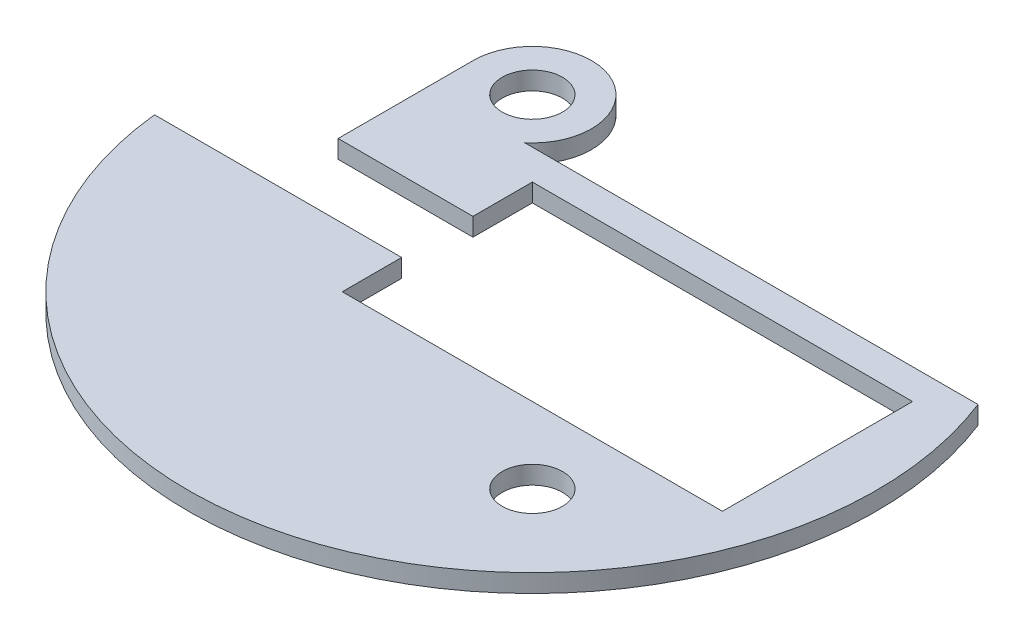
ISO-10303-21;
HEADER;
FILE_DESCRIPTION(('STEP AP214'),'2;1');
FILE_NAME('part.step','',(''),(''),'','','');
FILE_SCHEMA(('AUTOMOTIVE_DESIGN { 1 0 10303 214 1 1 1 1 }'));
ENDSEC;
DATA;
#1=APPLICATION_CONTEXT('core data for automotive mechanical design processes');
#2=APPLICATION_PROTOCOL_DEFINITION('international standard','automotive_design',2000,#1);
#3=PRODUCT_CONTEXT('',#1,'mechanical');
#4=PRODUCT('Part','Part','',(#3));
#5=PRODUCT_RELATED_PRODUCT_CATEGORY('part','',(#4));
#6=PRODUCT_DEFINITION_FORMATION('','',#4);
#7=PRODUCT_DEFINITION_CONTEXT('part definition',#1,'design');
#8=PRODUCT_DEFINITION('design','',#6,#7);
#9=PRODUCT_DEFINITION_SHAPE('','',#8);
#10=(LENGTH_UNIT() NAMED_UNIT(*) SI_UNIT(.MILLI.,.METRE.));
#11=(NAMED_UNIT(*) PLANE_ANGLE_UNIT() SI_UNIT($,.RADIAN.));
#12=(NAMED_UNIT(*) SI_UNIT($,.STERADIAN.) SOLID_ANGLE_UNIT());
#13=UNCERTAINTY_MEASURE_WITH_UNIT(LENGTH_MEASURE(1.E-05),#10,'distance_accuracy_value','');
#14=(GEOMETRIC_REPRESENTATION_CONTEXT(3) GLOBAL_UNCERTAINTY_ASSIGNED_CONTEXT((#13)) GLOBAL_UNIT_ASSIGNED_CONTEXT((#10,
#11,#12)) REPRESENTATION_CONTEXT('',''));
#15=CARTESIAN_POINT('',(0.,0.,0.));
#16=DIRECTION('',(0.,0.,1.));
#17=DIRECTION('',(1.,0.,0.));
#18=AXIS2_PLACEMENT_3D('',#15,#16,#17);
#19=CARTESIAN_POINT('',(0.,1.905,0.));
#20=DIRECTION('',(0.,1.,0.));
#21=DIRECTION('',(0.,0.,1.));
#22=AXIS2_PLACEMENT_3D('',#19,#20,#21);
#23=PLANE('',#22);
#24=CARTESIAN_POINT('',(-17.9605122421383,1.905,-17.9605122421383));
#25=DIRECTION('',(0.,1.,0.));
#26=DIRECTION('',(0.,0.,1.));
#27=AXIS2_PLACEMENT_3D('',#24,#25,#26);
#28=CIRCLE('',#27,3.175);
#29=CARTESIAN_POINT('',(-17.9605122421383,1.905,-14.7855122421383));
#30=VERTEX_POINT('',#29);
#31=EDGE_CURVE('E157',#30,#30,#28,.T.);
#32=ORIENTED_EDGE('',*,*,#31,.F.);
#33=EDGE_LOOP('',(#32));
#34=FACE_BOUND('',#33,.T.);
#35=DIRECTION('',(0.,0.,-1.));
#36=VECTOR('',#35,1.);
#37=CARTESIAN_POINT('',(-10.,1.905,-3.75));
#38=LINE('',#37,#36);
#39=CARTESIAN_POINT('',(-10.,1.905,-3.75));
#40=VERTEX_POINT('',#39);
#41=CARTESIAN_POINT('',(-10.,1.905,-10.));
#42=VERTEX_POINT('',#41);
#43=EDGE_CURVE('E177',#40,#42,#38,.T.);
#44=ORIENTED_EDGE('',*,*,#43,.T.);
#45=DIRECTION('',(1.,0.,0.));
#46=VECTOR('',#45,1.);
#47=CARTESIAN_POINT('',(30.,1.905,-10.));
#48=LINE('',#47,#46);
#49=CARTESIAN_POINT('',(30.,1.905,-10.));
#50=VERTEX_POINT('',#49);
#51=EDGE_CURVE('E108',#42,#50,#48,.T.);
#52=ORIENTED_EDGE('',*,*,#51,.T.);
#53=DIRECTION('',(0.,0.,1.));
#54=VECTOR('',#53,1.);
#55=CARTESIAN_POINT('',(30.,1.905,10.));
#56=LINE('',#55,#54);
#57=CARTESIAN_POINT('',(30.,1.905,10.));
#58=VERTEX_POINT('',#57);
#59=EDGE_CURVE('E201',#50,#58,#56,.T.);
#60=ORIENTED_EDGE('',*,*,#59,.T.);
#61=DIRECTION('',(-1.,0.,0.));
#62=VECTOR('',#61,1.);
#63=CARTESIAN_POINT('',(30.,1.905,10.));
#64=LINE('',#63,#62);
#65=CARTESIAN_POINT('',(-10.,1.905,10.));
#66=VERTEX_POINT('',#65);
#67=EDGE_CURVE('E218',#58,#66,#64,.T.);
#68=ORIENTED_EDGE('',*,*,#67,.T.);
#69=DIRECTION('',(0.,0.,-1.));
#70=VECTOR('',#69,1.);
#71=CARTESIAN_POINT('',(-10.,1.905,10.));
#72=LINE('',#71,#70);
#73=CARTESIAN_POINT('',(-10.,1.905,3.75));
#74=VERTEX_POINT('',#73);
#75=EDGE_CURVE('E215',#66,#74,#72,.T.);
#76=ORIENTED_EDGE('',*,*,#75,.T.);
#77=DIRECTION('',(-1.,0.,0.));
#78=VECTOR('',#77,1.);
#79=CARTESIAN_POINT('',(-24.1835122421383,1.905,3.75));
#80=LINE('',#79,#78);
#81=CARTESIAN_POINT('',(-36.0002156243543,1.905,3.75));
#82=VERTEX_POINT('',#81);
#83=EDGE_CURVE('E217',#74,#82,#80,.T.);
#84=ORIENTED_EDGE('',*,*,#83,.T.);
#85=CARTESIAN_POINT('',(0.,1.905,0.));
#86=DIRECTION('',(0.,1.,0.));
#87=DIRECTION('',(0.,0.,1.));
#88=AXIS2_PLACEMENT_3D('',#85,#86,#87);
#89=CIRCLE('',#88,36.195);
#90=CARTESIAN_POINT('',(33.7119771001346,1.905,-13.175));
#91=VERTEX_POINT('',#90);
#92=EDGE_CURVE('E220',#82,#91,#89,.T.);
#93=ORIENTED_EDGE('',*,*,#92,.T.);
#94=DIRECTION('',(-1.,0.,0.));
#95=VECTOR('',#94,1.);
#96=CARTESIAN_POINT('',(33.7119771001346,1.905,-13.175));
#97=LINE('',#96,#95);
#98=CARTESIAN_POINT('',(-13.9824974633392,1.905,-13.175));
#99=VERTEX_POINT('',#98);
#100=EDGE_CURVE('E136',#91,#99,#97,.T.);
#101=ORIENTED_EDGE('',*,*,#100,.T.);
#102=CARTESIAN_POINT('',(-17.9605122421383,1.905,-17.9605122421383));
#103=DIRECTION('',(0.,1.,0.));
#104=DIRECTION('',(0.,0.,1.));
#105=AXIS2_PLACEMENT_3D('',#102,#103,#104);
#106=CIRCLE('',#105,6.223);
#107=CARTESIAN_POINT('',(-24.1835122421383,1.905,-17.9605122421383));
#108=VERTEX_POINT('',#107);
#109=EDGE_CURVE('E130',#99,#108,#106,.T.);
#110=ORIENTED_EDGE('',*,*,#109,.T.);
#111=DIRECTION('',(0.,0.,1.));
#112=VECTOR('',#111,1.);
#113=CARTESIAN_POINT('',(-24.1835122421383,1.905,-17.9605122421383));
#114=LINE('',#113,#112);
#115=CARTESIAN_POINT('',(-24.1835122421383,1.905,-3.75));
#116=VERTEX_POINT('',#115);
#117=EDGE_CURVE('E134',#108,#116,#114,.T.);
#118=ORIENTED_EDGE('',*,*,#117,.T.);
#119=DIRECTION('',(1.,0.,0.));
#120=VECTOR('',#119,1.);
#121=CARTESIAN_POINT('',(-24.1835122421383,1.905,-3.75));
#122=LINE('',#121,#120);
#123=EDGE_CURVE('E56',#116,#40,#122,.T.);
#124=ORIENTED_EDGE('',*,*,#123,.T.);
#125=EDGE_LOOP('',(#44,#52,#60,#68,#76,#84,#93,#101,#110,#118,#124));
#126=FACE_BOUND('',#125,.T.);
#127=CARTESIAN_POINT('',(17.9605122421383,1.905,17.9605122421383));
#128=DIRECTION('',(0.,1.,0.));
#129=DIRECTION('',(0.,0.,1.));
#130=AXIS2_PLACEMENT_3D('',#127,#128,#129);
#131=CIRCLE('',#130,3.175);
#132=CARTESIAN_POINT('',(17.9605122421383,1.905,21.1355122421383));
#133=VERTEX_POINT('',#132);
#134=EDGE_CURVE('E265',#133,#133,#131,.T.);
#135=ORIENTED_EDGE('',*,*,#134,.F.);
#136=EDGE_LOOP('',(#135));
#137=FACE_BOUND('',#136,.T.);
#138=ADVANCED_FACE('F39',(#34,#126,#137),#23,.T.);
#139=CARTESIAN_POINT('',(0.,0.,0.));
#140=DIRECTION('',(0.,1.,0.));
#141=DIRECTION('',(0.,0.,1.));
#142=AXIS2_PLACEMENT_3D('',#139,#140,#141);
#143=PLANE('',#142);
#144=DIRECTION('',(0.,0.,-1.));
#145=VECTOR('',#144,1.);
#146=CARTESIAN_POINT('',(-10.,0.,-3.75));
#147=LINE('',#146,#145);
#148=CARTESIAN_POINT('',(-10.,0.,-3.75));
#149=VERTEX_POINT('',#148);
#150=CARTESIAN_POINT('',(-10.,0.,-10.));
#151=VERTEX_POINT('',#150);
#152=EDGE_CURVE('E153',#149,#151,#147,.T.);
#153=ORIENTED_EDGE('',*,*,#152,.F.);
#154=DIRECTION('',(1.,0.,0.));
#155=VECTOR('',#154,1.);
#156=CARTESIAN_POINT('',(-24.1835122421383,0.,-3.75));
#157=LINE('',#156,#155);
#158=CARTESIAN_POINT('',(-24.1835122421383,0.,-3.75));
#159=VERTEX_POINT('',#158);
#160=EDGE_CURVE('E100',#159,#149,#157,.T.);
#161=ORIENTED_EDGE('',*,*,#160,.F.);
#162=DIRECTION('',(0.,0.,1.));
#163=VECTOR('',#162,1.);
#164=CARTESIAN_POINT('',(-24.1835122421383,0.,-17.9605122421383));
#165=LINE('',#164,#163);
#166=CARTESIAN_POINT('',(-24.1835122421383,0.,-17.9605122421383));
#167=VERTEX_POINT('',#166);
#168=EDGE_CURVE('E94',#167,#159,#165,.T.);
#169=ORIENTED_EDGE('',*,*,#168,.F.);
#170=CARTESIAN_POINT('',(-17.9605122421383,0.,-17.9605122421383));
#171=DIRECTION('',(0.,1.,0.));
#172=DIRECTION('',(0.,0.,1.));
#173=AXIS2_PLACEMENT_3D('',#170,#171,#172);
#174=CIRCLE('',#173,6.223);
#175=CARTESIAN_POINT('',(-13.9824974633392,0.,-13.175));
#176=VERTEX_POINT('',#175);
#177=EDGE_CURVE('E143',#176,#167,#174,.T.);
#178=ORIENTED_EDGE('',*,*,#177,.F.);
#179=DIRECTION('',(-1.,0.,0.));
#180=VECTOR('',#179,1.);
#181=CARTESIAN_POINT('',(33.7119771001346,0.,-13.175));
#182=LINE('',#181,#180);
#183=CARTESIAN_POINT('',(33.7119771001346,0.,-13.175));
#184=VERTEX_POINT('',#183);
#185=EDGE_CURVE('E171',#184,#176,#182,.T.);
#186=ORIENTED_EDGE('',*,*,#185,.F.);
#187=CARTESIAN_POINT('',(0.,0.,0.));
#188=DIRECTION('',(0.,1.,0.));
#189=DIRECTION('',(0.,0.,1.));
#190=AXIS2_PLACEMENT_3D('',#187,#188,#189);
#191=CIRCLE('',#190,36.195);
#192=CARTESIAN_POINT('',(-36.0002156243543,0.,3.75));
#193=VERTEX_POINT('',#192);
#194=EDGE_CURVE('E169',#193,#184,#191,.T.);
#195=ORIENTED_EDGE('',*,*,#194,.F.);
#196=DIRECTION('',(-1.,0.,0.));
#197=VECTOR('',#196,1.);
#198=CARTESIAN_POINT('',(-24.1835122421383,0.,3.75));
#199=LINE('',#198,#197);
#200=CARTESIAN_POINT('',(-10.,0.,3.75));
#201=VERTEX_POINT('',#200);
#202=EDGE_CURVE('E167',#201,#193,#199,.T.);
#203=ORIENTED_EDGE('',*,*,#202,.F.);
#204=DIRECTION('',(0.,0.,-1.));
#205=VECTOR('',#204,1.);
#206=CARTESIAN_POINT('',(-10.,0.,10.));
#207=LINE('',#206,#205);
#208=CARTESIAN_POINT('',(-10.,0.,10.));
#209=VERTEX_POINT('',#208);
#210=EDGE_CURVE('E164',#209,#201,#207,.T.);
#211=ORIENTED_EDGE('',*,*,#210,.F.);
#212=DIRECTION('',(-1.,0.,0.));
#213=VECTOR('',#212,1.);
#214=CARTESIAN_POINT('',(0.,0.,10.));
#215=LINE('',#214,#213);
#216=CARTESIAN_POINT('',(30.,0.,10.));
#217=VERTEX_POINT('',#216);
#218=EDGE_CURVE('E162',#217,#209,#215,.T.);
#219=ORIENTED_EDGE('',*,*,#218,.F.);
#220=DIRECTION('',(0.,0.,1.));
#221=VECTOR('',#220,1.);
#222=CARTESIAN_POINT('',(30.,0.,10.));
#223=LINE('',#222,#221);
#224=CARTESIAN_POINT('',(30.,0.,-10.));
#225=VERTEX_POINT('',#224);
#226=EDGE_CURVE('E159',#225,#217,#223,.T.);
#227=ORIENTED_EDGE('',*,*,#226,.F.);
#228=DIRECTION('',(1.,0.,0.));
#229=VECTOR('',#228,1.);
#230=CARTESIAN_POINT('',(30.,0.,-10.));
#231=LINE('',#230,#229);
#232=EDGE_CURVE('E156',#151,#225,#231,.T.);
#233=ORIENTED_EDGE('',*,*,#232,.F.);
#234=EDGE_LOOP('',(#153,#161,#169,#178,#186,#195,#203,#211,#219,#227,#233));
#235=FACE_BOUND('',#234,.T.);
#236=CARTESIAN_POINT('',(-17.9605122421383,0.,-17.9605122421383));
#237=DIRECTION('',(0.,1.,0.));
#238=DIRECTION('',(0.,0.,1.));
#239=AXIS2_PLACEMENT_3D('',#236,#237,#238);
#240=CIRCLE('',#239,3.175);
#241=CARTESIAN_POINT('',(-17.9605122421383,0.,-14.7855122421383));
#242=VERTEX_POINT('',#241);
#243=EDGE_CURVE('E271',#242,#242,#240,.T.);
#244=ORIENTED_EDGE('',*,*,#243,.T.);
#245=EDGE_LOOP('',(#244));
#246=FACE_BOUND('',#245,.T.);
#247=CARTESIAN_POINT('',(17.9605122421383,0.,17.9605122421383));
#248=DIRECTION('',(0.,1.,0.));
#249=DIRECTION('',(0.,0.,1.));
#250=AXIS2_PLACEMENT_3D('',#247,#248,#249);
#251=CIRCLE('',#250,3.175);
#252=CARTESIAN_POINT('',(17.9605122421383,0.,21.1355122421383));
#253=VERTEX_POINT('',#252);
#254=EDGE_CURVE('E268',#253,#253,#251,.T.);
#255=ORIENTED_EDGE('',*,*,#254,.T.);
#256=EDGE_LOOP('',(#255));
#257=FACE_BOUND('',#256,.T.);
#258=ADVANCED_FACE('F204',(#235,#246,#257),#143,.F.);
#259=CARTESIAN_POINT('',(-10.,1.905,-3.75));
#260=DIRECTION('',(-1.,0.,0.));
#261=DIRECTION('',(0.,0.,1.));
#262=AXIS2_PLACEMENT_3D('',#259,#260,#261);
#263=PLANE('',#262);
#264=ORIENTED_EDGE('',*,*,#152,.T.);
#265=DIRECTION('',(0.,-1.,0.));
#266=VECTOR('',#265,1.);
#267=CARTESIAN_POINT('',(-10.,1.905,-10.));
#268=LINE('',#267,#266);
#269=EDGE_CURVE('E11',#42,#151,#268,.T.);
#270=ORIENTED_EDGE('',*,*,#269,.F.);
#271=ORIENTED_EDGE('',*,*,#43,.F.);
#272=DIRECTION('',(0.,-1.,0.));
#273=VECTOR('',#272,1.);
#274=CARTESIAN_POINT('',(-10.,1.905,-3.75));
#275=LINE('',#274,#273);
#276=EDGE_CURVE('E149',#40,#149,#275,.T.);
#277=ORIENTED_EDGE('',*,*,#276,.T.);
#278=EDGE_LOOP('',(#264,#270,#271,#277));
#279=FACE_BOUND('',#278,.T.);
#280=ADVANCED_FACE('F41',(#279),#263,.F.);
#281=CARTESIAN_POINT('',(30.,1.905,-10.));
#282=DIRECTION('',(0.,0.,-1.));
#283=DIRECTION('',(-1.,0.,0.));
#284=AXIS2_PLACEMENT_3D('',#281,#282,#283);
#285=PLANE('',#284);
#286=ORIENTED_EDGE('',*,*,#232,.T.);
#287=DIRECTION('',(0.,-1.,0.));
#288=VECTOR('',#287,1.);
#289=CARTESIAN_POINT('',(30.,1.905,-10.));
#290=LINE('',#289,#288);
#291=EDGE_CURVE('E48',#50,#225,#290,.T.);
#292=ORIENTED_EDGE('',*,*,#291,.F.);
#293=ORIENTED_EDGE('',*,*,#51,.F.);
#294=ORIENTED_EDGE('',*,*,#269,.T.);
#295=EDGE_LOOP('',(#286,#292,#293,#294));
#296=FACE_BOUND('',#295,.T.);
#297=ADVANCED_FACE('F352',(#296),#285,.F.);
#298=CARTESIAN_POINT('',(30.,1.905,10.));
#299=DIRECTION('',(1.,0.,0.));
#300=DIRECTION('',(0.,0.,-1.));
#301=AXIS2_PLACEMENT_3D('',#298,#299,#300);
#302=PLANE('',#301);
#303=ORIENTED_EDGE('',*,*,#226,.T.);
#304=DIRECTION('',(0.,-1.,0.));
#305=VECTOR('',#304,1.);
#306=CARTESIAN_POINT('',(30.,1.905,10.));
#307=LINE('',#306,#305);
#308=EDGE_CURVE('E193',#58,#217,#307,.T.);
#309=ORIENTED_EDGE('',*,*,#308,.F.);
#310=ORIENTED_EDGE('',*,*,#59,.F.);
#311=ORIENTED_EDGE('',*,*,#291,.T.);
#312=EDGE_LOOP('',(#303,#309,#310,#311));
#313=FACE_BOUND('',#312,.T.);
#314=ADVANCED_FACE('F199',(#313),#302,.F.);
#315=CARTESIAN_POINT('',(0.,1.905,10.));
#316=DIRECTION('',(0.,0.,1.));
#317=DIRECTION('',(1.,0.,0.));
#318=AXIS2_PLACEMENT_3D('',#315,#316,#317);
#319=PLANE('',#318);
#320=ORIENTED_EDGE('',*,*,#218,.T.);
#321=DIRECTION('',(0.,-1.,0.));
#322=VECTOR('',#321,1.);
#323=CARTESIAN_POINT('',(-10.,1.905,10.));
#324=LINE('',#323,#322);
#325=EDGE_CURVE('E190',#66,#209,#324,.T.);
#326=ORIENTED_EDGE('',*,*,#325,.F.);
#327=ORIENTED_EDGE('',*,*,#67,.F.);
#328=ORIENTED_EDGE('',*,*,#308,.T.);
#329=EDGE_LOOP('',(#320,#326,#327,#328));
#330=FACE_BOUND('',#329,.T.);
#331=ADVANCED_FACE('F209',(#330),#319,.F.);
#332=CARTESIAN_POINT('',(-10.,1.905,10.));
#333=DIRECTION('',(-1.,0.,0.));
#334=DIRECTION('',(0.,0.,1.));
#335=AXIS2_PLACEMENT_3D('',#332,#333,#334);
#336=PLANE('',#335);
#337=ORIENTED_EDGE('',*,*,#210,.T.);
#338=DIRECTION('',(0.,-1.,0.));
#339=VECTOR('',#338,1.);
#340=CARTESIAN_POINT('',(-10.,1.905,3.75));
#341=LINE('',#340,#339);
#342=EDGE_CURVE('E187',#74,#201,#341,.T.);
#343=ORIENTED_EDGE('',*,*,#342,.F.);
#344=ORIENTED_EDGE('',*,*,#75,.F.);
#345=ORIENTED_EDGE('',*,*,#325,.T.);
#346=EDGE_LOOP('',(#337,#343,#344,#345));
#347=FACE_BOUND('',#346,.T.);
#348=ADVANCED_FACE('F213',(#347),#336,.F.);
#349=CARTESIAN_POINT('',(-24.1835122421383,1.905,3.75));
#350=DIRECTION('',(0.,0.,1.));
#351=DIRECTION('',(1.,0.,0.));
#352=AXIS2_PLACEMENT_3D('',#349,#350,#351);
#353=PLANE('',#352);
#354=ORIENTED_EDGE('',*,*,#202,.T.);
#355=DIRECTION('',(0.,-1.,0.));
#356=VECTOR('',#355,1.);
#357=CARTESIAN_POINT('',(-36.0002156243543,1.905,3.75));
#358=LINE('',#357,#356);
#359=EDGE_CURVE('E184',#82,#193,#358,.T.);
#360=ORIENTED_EDGE('',*,*,#359,.F.);
#361=ORIENTED_EDGE('',*,*,#83,.F.);
#362=ORIENTED_EDGE('',*,*,#342,.T.);
#363=EDGE_LOOP('',(#354,#360,#361,#362));
#364=FACE_BOUND('',#363,.T.);
#365=ADVANCED_FACE('F322',(#364),#353,.F.);
#366=CARTESIAN_POINT('',(0.,1.905,0.));
#367=DIRECTION('',(0.,-1.,0.));
#368=DIRECTION('',(0.,0.,-1.));
#369=AXIS2_PLACEMENT_3D('',#366,#367,#368);
#370=CYLINDRICAL_SURFACE('',#369,36.195);
#371=ORIENTED_EDGE('',*,*,#194,.T.);
#372=DIRECTION('',(0.,-1.,0.));
#373=VECTOR('',#372,1.);
#374=CARTESIAN_POINT('',(33.7119771001346,1.905,-13.175));
#375=LINE('',#374,#373);
#376=EDGE_CURVE('E181',#91,#184,#375,.T.);
#377=ORIENTED_EDGE('',*,*,#376,.F.);
#378=ORIENTED_EDGE('',*,*,#92,.F.);
#379=ORIENTED_EDGE('',*,*,#359,.T.);
#380=EDGE_LOOP('',(#371,#377,#378,#379));
#381=FACE_BOUND('',#380,.T.);
#382=ADVANCED_FACE('F229',(#381),#370,.T.);
#383=CARTESIAN_POINT('',(33.7119771001346,1.905,-13.175));
#384=DIRECTION('',(0.,0.,1.));
#385=DIRECTION('',(1.,0.,0.));
#386=AXIS2_PLACEMENT_3D('',#383,#384,#385);
#387=PLANE('',#386);
#388=ORIENTED_EDGE('',*,*,#185,.T.);
#389=DIRECTION('',(0.,-1.,0.));
#390=VECTOR('',#389,1.);
#391=CARTESIAN_POINT('',(-13.9824974633392,1.905,-13.175));
#392=LINE('',#391,#390);
#393=EDGE_CURVE('E144',#99,#176,#392,.T.);
#394=ORIENTED_EDGE('',*,*,#393,.F.);
#395=ORIENTED_EDGE('',*,*,#100,.F.);
#396=ORIENTED_EDGE('',*,*,#376,.T.);
#397=EDGE_LOOP('',(#388,#394,#395,#396));
#398=FACE_BOUND('',#397,.T.);
#399=ADVANCED_FACE('F233',(#398),#387,.F.);
#400=CARTESIAN_POINT('',(-17.9605122421383,1.905,-17.9605122421383));
#401=DIRECTION('',(0.,-1.,0.));
#402=DIRECTION('',(0.,0.,-1.));
#403=AXIS2_PLACEMENT_3D('',#400,#401,#402);
#404=CYLINDRICAL_SURFACE('',#403,6.223);
#405=ORIENTED_EDGE('',*,*,#177,.T.);
#406=DIRECTION('',(0.,-1.,0.));
#407=VECTOR('',#406,1.);
#408=CARTESIAN_POINT('',(-24.1835122421383,1.905,-17.9605122421383));
#409=LINE('',#408,#407);
#410=EDGE_CURVE('E141',#108,#167,#409,.T.);
#411=ORIENTED_EDGE('',*,*,#410,.F.);
#412=ORIENTED_EDGE('',*,*,#109,.F.);
#413=ORIENTED_EDGE('',*,*,#393,.T.);
#414=EDGE_LOOP('',(#405,#411,#412,#413));
#415=FACE_BOUND('',#414,.T.);
#416=ADVANCED_FACE('F142',(#415),#404,.T.);
#417=CARTESIAN_POINT('',(-24.1835122421383,1.905,-17.9605122421383));
#418=DIRECTION('',(1.,0.,0.));
#419=DIRECTION('',(0.,0.,-1.));
#420=AXIS2_PLACEMENT_3D('',#417,#418,#419);
#421=PLANE('',#420);
#422=ORIENTED_EDGE('',*,*,#168,.T.);
#423=DIRECTION('',(0.,-1.,0.));
#424=VECTOR('',#423,1.);
#425=CARTESIAN_POINT('',(-24.1835122421383,1.905,-3.75));
#426=LINE('',#425,#424);
#427=EDGE_CURVE('E145',#116,#159,#426,.T.);
#428=ORIENTED_EDGE('',*,*,#427,.F.);
#429=ORIENTED_EDGE('',*,*,#117,.F.);
#430=ORIENTED_EDGE('',*,*,#410,.T.);
#431=EDGE_LOOP('',(#422,#428,#429,#430));
#432=FACE_BOUND('',#431,.T.);
#433=ADVANCED_FACE('F147',(#432),#421,.F.);
#434=CARTESIAN_POINT('',(-24.1835122421383,1.905,-3.75));
#435=DIRECTION('',(0.,0.,-1.));
#436=DIRECTION('',(-1.,0.,0.));
#437=AXIS2_PLACEMENT_3D('',#434,#435,#436);
#438=PLANE('',#437);
#439=ORIENTED_EDGE('',*,*,#160,.T.);
#440=ORIENTED_EDGE('',*,*,#276,.F.);
#441=ORIENTED_EDGE('',*,*,#123,.F.);
#442=ORIENTED_EDGE('',*,*,#427,.T.);
#443=EDGE_LOOP('',(#439,#440,#441,#442));
#444=FACE_BOUND('',#443,.T.);
#445=ADVANCED_FACE('F237',(#444),#438,.F.);
#446=CARTESIAN_POINT('',(-17.9605122421383,1.905,-17.9605122421383));
#447=DIRECTION('',(0.,-1.,0.));
#448=DIRECTION('',(0.,0.,-1.));
#449=AXIS2_PLACEMENT_3D('',#446,#447,#448);
#450=CYLINDRICAL_SURFACE('',#449,3.175);
#451=ORIENTED_EDGE('',*,*,#31,.T.);
#452=EDGE_LOOP('',(#451));
#453=FACE_BOUND('',#452,.T.);
#454=ORIENTED_EDGE('',*,*,#243,.F.);
#455=EDGE_LOOP('',(#454));
#456=FACE_BOUND('',#455,.T.);
#457=ADVANCED_FACE('F239',(#453,#456),#450,.F.);
#458=CARTESIAN_POINT('',(17.9605122421383,1.905,17.9605122421383));
#459=DIRECTION('',(0.,-1.,0.));
#460=DIRECTION('',(0.,0.,-1.));
#461=AXIS2_PLACEMENT_3D('',#458,#459,#460);
#462=CYLINDRICAL_SURFACE('',#461,3.175);
#463=ORIENTED_EDGE('',*,*,#134,.T.);
#464=EDGE_LOOP('',(#463));
#465=FACE_BOUND('',#464,.T.);
#466=ORIENTED_EDGE('',*,*,#254,.F.);
#467=EDGE_LOOP('',(#466));
#468=FACE_BOUND('',#467,.T.);
#469=ADVANCED_FACE('F245',(#465,#468),#462,.F.);
#470=CLOSED_SHELL('',(#138,#258,#280,#297,#314,#331,#348,#365,#382,#399,#416,#433,#445,#457,#469));
#471=MANIFOLD_SOLID_BREP('B2',#470);
#472=ADVANCED_BREP_SHAPE_REPRESENTATION('',(#18,#471),#14);
#473=SHAPE_DEFINITION_REPRESENTATION(#9,#472);
ENDSEC;
END-ISO-10303-21;
